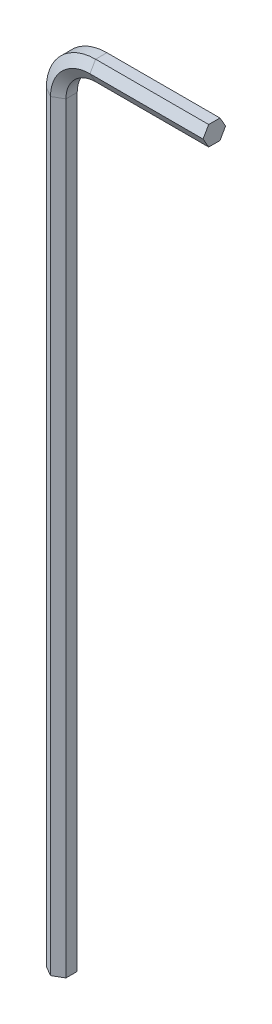
ISO-10303-21;
HEADER;
FILE_DESCRIPTION(('STEP AP214'),'2;1');
FILE_NAME('part.step','',(''),(''),'','','');
FILE_SCHEMA(('AUTOMOTIVE_DESIGN { 1 0 10303 214 1 1 1 1 }'));
ENDSEC;
DATA;
#1=APPLICATION_CONTEXT('core data for automotive mechanical design processes');
#2=APPLICATION_PROTOCOL_DEFINITION('international standard','automotive_design',2000,#1);
#3=PRODUCT_CONTEXT('',#1,'mechanical');
#4=PRODUCT('Part','Part','',(#3));
#5=PRODUCT_RELATED_PRODUCT_CATEGORY('part','',(#4));
#6=PRODUCT_DEFINITION_FORMATION('','',#4);
#7=PRODUCT_DEFINITION_CONTEXT('part definition',#1,'design');
#8=PRODUCT_DEFINITION('design','',#6,#7);
#9=PRODUCT_DEFINITION_SHAPE('','',#8);
#10=(LENGTH_UNIT() NAMED_UNIT(*) SI_UNIT(.MILLI.,.METRE.));
#11=(NAMED_UNIT(*) PLANE_ANGLE_UNIT() SI_UNIT($,.RADIAN.));
#12=(NAMED_UNIT(*) SI_UNIT($,.STERADIAN.) SOLID_ANGLE_UNIT());
#13=UNCERTAINTY_MEASURE_WITH_UNIT(LENGTH_MEASURE(1.E-05),#10,'distance_accuracy_value','');
#14=(GEOMETRIC_REPRESENTATION_CONTEXT(3) GLOBAL_UNCERTAINTY_ASSIGNED_CONTEXT((#13)) GLOBAL_UNIT_ASSIGNED_CONTEXT((#10,
#11,#12)) REPRESENTATION_CONTEXT('',''));
#15=CARTESIAN_POINT('',(0.,0.,0.));
#16=DIRECTION('',(0.,0.,1.));
#17=DIRECTION('',(1.,0.,0.));
#18=AXIS2_PLACEMENT_3D('',#15,#16,#17);
#19=CARTESIAN_POINT('',(4.00000000000005,82.2,-0.571923176659244));
#20=DIRECTION('',(0.,1.,0.));
#21=DIRECTION('',(0.,0.,1.));
#22=AXIS2_PLACEMENT_3D('',#19,#20,#21);
#23=PLANE('',#22);
#24=DIRECTION('',(0.,0.,1.));
#25=VECTOR('',#24,1.);
#26=CARTESIAN_POINT('',(4.00000000000005,82.2,-0.571923176659244));
#27=LINE('',#26,#25);
#28=CARTESIAN_POINT('',(4.00000000000005,82.2,-0.571923176659244));
#29=VERTEX_POINT('',#28);
#30=CARTESIAN_POINT('',(4.00000000000005,82.2,0.571923176659243));
#31=VERTEX_POINT('',#30);
#32=EDGE_CURVE('E143',#29,#31,#27,.T.);
#33=ORIENTED_EDGE('',*,*,#32,.T.);
#34=DIRECTION('',(1.,0.,0.));
#35=VECTOR('',#34,1.);
#36=CARTESIAN_POINT('',(4.00000000000005,82.2,0.571923176659243));
#37=LINE('',#36,#35);
#38=CARTESIAN_POINT('',(15.4694,82.2,0.571923176659243));
#39=VERTEX_POINT('',#38);
#40=EDGE_CURVE('E23',#31,#39,#37,.T.);
#41=ORIENTED_EDGE('',*,*,#40,.T.);
#42=DIRECTION('',(0.,0.,1.));
#43=VECTOR('',#42,1.);
#44=CARTESIAN_POINT('',(15.4694,82.2,-0.571923176659244));
#45=LINE('',#44,#43);
#46=CARTESIAN_POINT('',(15.4694,82.2,-0.571923176659244));
#47=VERTEX_POINT('',#46);
#48=EDGE_CURVE('E35',#47,#39,#45,.T.);
#49=ORIENTED_EDGE('',*,*,#48,.F.);
#50=DIRECTION('',(1.,0.,0.));
#51=VECTOR('',#50,1.);
#52=CARTESIAN_POINT('',(4.00000000000005,82.2,-0.571923176659244));
#53=LINE('',#52,#51);
#54=EDGE_CURVE('E10',#29,#47,#53,.T.);
#55=ORIENTED_EDGE('',*,*,#54,.F.);
#56=EDGE_LOOP('',(#33,#41,#49,#55));
#57=FACE_BOUND('',#56,.T.);
#58=ADVANCED_FACE('F15',(#57),#23,.T.);
#59=CARTESIAN_POINT('',(4.00000000000005,82.2,0.571923176659243));
#60=DIRECTION('',(0.,0.5,0.866025403784439));
#61=DIRECTION('',(0.,-0.866025403784439,0.5));
#62=AXIS2_PLACEMENT_3D('',#59,#60,#61);
#63=PLANE('',#62);
#64=DIRECTION('',(0.,-0.866025403784439,0.5));
#65=VECTOR('',#64,1.);
#66=CARTESIAN_POINT('',(4.00000000000005,82.2,0.571923176659243));
#67=LINE('',#66,#65);
#68=CARTESIAN_POINT('',(4.00000000000003,81.2094,1.14384635331849));
#69=VERTEX_POINT('',#68);
#70=EDGE_CURVE('E201',#31,#69,#67,.T.);
#71=ORIENTED_EDGE('',*,*,#70,.T.);
#72=DIRECTION('',(1.,0.,0.));
#73=VECTOR('',#72,1.);
#74=CARTESIAN_POINT('',(4.00000000000003,81.2094,1.14384635331849));
#75=LINE('',#74,#73);
#76=CARTESIAN_POINT('',(15.4694,81.2094,1.14384635331849));
#77=VERTEX_POINT('',#76);
#78=EDGE_CURVE('E253',#69,#77,#75,.T.);
#79=ORIENTED_EDGE('',*,*,#78,.T.);
#80=DIRECTION('',(0.,-0.866025403784439,0.5));
#81=VECTOR('',#80,1.);
#82=CARTESIAN_POINT('',(15.4694,82.2,0.571923176659243));
#83=LINE('',#82,#81);
#84=EDGE_CURVE('E45',#39,#77,#83,.T.);
#85=ORIENTED_EDGE('',*,*,#84,.F.);
#86=ORIENTED_EDGE('',*,*,#40,.F.);
#87=EDGE_LOOP('',(#71,#79,#85,#86));
#88=FACE_BOUND('',#87,.T.);
#89=ADVANCED_FACE('F258',(#88),#63,.T.);
#90=CARTESIAN_POINT('',(4.00000000000003,81.2094,1.14384635331849));
#91=DIRECTION('',(0.,-0.5,0.866025403784439));
#92=DIRECTION('',(0.,-0.866025403784439,-0.5));
#93=AXIS2_PLACEMENT_3D('',#90,#91,#92);
#94=PLANE('',#93);
#95=DIRECTION('',(0.,-0.866025403784439,-0.5));
#96=VECTOR('',#95,1.);
#97=CARTESIAN_POINT('',(4.00000000000003,81.2094,1.14384635331849));
#98=LINE('',#97,#96);
#99=CARTESIAN_POINT('',(4.00000000000002,80.2188,0.571923176659244));
#100=VERTEX_POINT('',#99);
#101=EDGE_CURVE('E197',#69,#100,#98,.T.);
#102=ORIENTED_EDGE('',*,*,#101,.T.);
#103=DIRECTION('',(1.,0.,0.));
#104=VECTOR('',#103,1.);
#105=CARTESIAN_POINT('',(4.00000000000002,80.2188,0.571923176659244));
#106=LINE('',#105,#104);
#107=CARTESIAN_POINT('',(15.4694,80.2188,0.571923176659244));
#108=VERTEX_POINT('',#107);
#109=EDGE_CURVE('E249',#100,#108,#106,.T.);
#110=ORIENTED_EDGE('',*,*,#109,.T.);
#111=DIRECTION('',(0.,-0.866025403784439,-0.5));
#112=VECTOR('',#111,1.);
#113=CARTESIAN_POINT('',(15.4694,81.2094,1.14384635331849));
#114=LINE('',#113,#112);
#115=EDGE_CURVE('E233',#77,#108,#114,.T.);
#116=ORIENTED_EDGE('',*,*,#115,.F.);
#117=ORIENTED_EDGE('',*,*,#78,.F.);
#118=EDGE_LOOP('',(#102,#110,#116,#117));
#119=FACE_BOUND('',#118,.T.);
#120=ADVANCED_FACE('F339',(#119),#94,.T.);
#121=CARTESIAN_POINT('',(4.00000000000002,80.2188,0.571923176659244));
#122=DIRECTION('',(0.,-1.,0.));
#123=DIRECTION('',(0.,0.,-1.));
#124=AXIS2_PLACEMENT_3D('',#121,#122,#123);
#125=PLANE('',#124);
#126=DIRECTION('',(0.,0.,-1.));
#127=VECTOR('',#126,1.);
#128=CARTESIAN_POINT('',(4.00000000000002,80.2188,0.571923176659244));
#129=LINE('',#128,#127);
#130=CARTESIAN_POINT('',(4.00000000000002,80.2188,-0.571923176659243));
#131=VERTEX_POINT('',#130);
#132=EDGE_CURVE('E193',#100,#131,#129,.T.);
#133=ORIENTED_EDGE('',*,*,#132,.T.);
#134=DIRECTION('',(1.,0.,0.));
#135=VECTOR('',#134,1.);
#136=CARTESIAN_POINT('',(4.00000000000002,80.2188,-0.571923176659243));
#137=LINE('',#136,#135);
#138=CARTESIAN_POINT('',(15.4694,80.2188,-0.571923176659243));
#139=VERTEX_POINT('',#138);
#140=EDGE_CURVE('E245',#131,#139,#137,.T.);
#141=ORIENTED_EDGE('',*,*,#140,.T.);
#142=DIRECTION('',(0.,0.,-1.));
#143=VECTOR('',#142,1.);
#144=CARTESIAN_POINT('',(15.4694,80.2188,0.571923176659244));
#145=LINE('',#144,#143);
#146=EDGE_CURVE('E229',#108,#139,#145,.T.);
#147=ORIENTED_EDGE('',*,*,#146,.F.);
#148=ORIENTED_EDGE('',*,*,#109,.F.);
#149=EDGE_LOOP('',(#133,#141,#147,#148));
#150=FACE_BOUND('',#149,.T.);
#151=ADVANCED_FACE('F338',(#150),#125,.T.);
#152=CARTESIAN_POINT('',(4.00000000000002,80.2188,-0.571923176659243));
#153=DIRECTION('',(0.,-0.5,-0.866025403784438));
#154=DIRECTION('',(0.,0.866025403784439,-0.5));
#155=AXIS2_PLACEMENT_3D('',#152,#153,#154);
#156=PLANE('',#155);
#157=DIRECTION('',(0.,0.866025403784439,-0.5));
#158=VECTOR('',#157,1.);
#159=CARTESIAN_POINT('',(4.00000000000002,80.2188,-0.571923176659243));
#160=LINE('',#159,#158);
#161=CARTESIAN_POINT('',(4.00000000000003,81.2094,-1.14384635331849));
#162=VERTEX_POINT('',#161);
#163=EDGE_CURVE('E184',#131,#162,#160,.T.);
#164=ORIENTED_EDGE('',*,*,#163,.T.);
#165=DIRECTION('',(1.,0.,0.));
#166=VECTOR('',#165,1.);
#167=CARTESIAN_POINT('',(4.00000000000003,81.2094,-1.14384635331849));
#168=LINE('',#167,#166);
#169=CARTESIAN_POINT('',(15.4694,81.2094,-1.14384635331849));
#170=VERTEX_POINT('',#169);
#171=EDGE_CURVE('E241',#162,#170,#168,.T.);
#172=ORIENTED_EDGE('',*,*,#171,.T.);
#173=DIRECTION('',(0.,0.866025403784439,-0.5));
#174=VECTOR('',#173,1.);
#175=CARTESIAN_POINT('',(15.4694,80.2188,-0.571923176659243));
#176=LINE('',#175,#174);
#177=EDGE_CURVE('E225',#139,#170,#176,.T.);
#178=ORIENTED_EDGE('',*,*,#177,.F.);
#179=ORIENTED_EDGE('',*,*,#140,.F.);
#180=EDGE_LOOP('',(#164,#172,#178,#179));
#181=FACE_BOUND('',#180,.T.);
#182=ADVANCED_FACE('F345',(#181),#156,.T.);
#183=CARTESIAN_POINT('',(4.00000000000003,81.2094,-1.14384635331849));
#184=DIRECTION('',(0.,0.5,-0.866025403784439));
#185=DIRECTION('',(0.,0.866025403784439,0.5));
#186=AXIS2_PLACEMENT_3D('',#183,#184,#185);
#187=PLANE('',#186);
#188=DIRECTION('',(0.,0.866025403784439,0.5));
#189=VECTOR('',#188,1.);
#190=CARTESIAN_POINT('',(4.00000000000003,81.2094,-1.14384635331849));
#191=LINE('',#190,#189);
#192=EDGE_CURVE('E177',#162,#29,#191,.T.);
#193=ORIENTED_EDGE('',*,*,#192,.T.);
#194=ORIENTED_EDGE('',*,*,#54,.T.);
#195=DIRECTION('',(0.,0.866025403784439,0.5));
#196=VECTOR('',#195,1.);
#197=CARTESIAN_POINT('',(15.4694,81.2094,-1.14384635331849));
#198=LINE('',#197,#196);
#199=EDGE_CURVE('E147',#170,#47,#198,.T.);
#200=ORIENTED_EDGE('',*,*,#199,.F.);
#201=ORIENTED_EDGE('',*,*,#171,.F.);
#202=EDGE_LOOP('',(#193,#194,#200,#201));
#203=FACE_BOUND('',#202,.T.);
#204=ADVANCED_FACE('F343',(#203),#187,.T.);
#205=CARTESIAN_POINT('',(4.,77.2094,0.));
#206=DIRECTION('',(0.,0.,-1.));
#207=DIRECTION('',(-1.,0.,0.));
#208=AXIS2_PLACEMENT_3D('',#205,#206,#207);
#209=CYLINDRICAL_SURFACE('',#208,4.9906);
#210=DIRECTION('',(0.,0.,1.));
#211=VECTOR('',#210,1.);
#212=CARTESIAN_POINT('',(-0.9906,77.2094,-0.571923176659244));
#213=LINE('',#212,#211);
#214=CARTESIAN_POINT('',(-0.9906,77.2094,-0.571923176659244));
#215=VERTEX_POINT('',#214);
#216=CARTESIAN_POINT('',(-0.9906,77.2094,0.571923176659243));
#217=VERTEX_POINT('',#216);
#218=EDGE_CURVE('E140',#215,#217,#213,.T.);
#219=ORIENTED_EDGE('',*,*,#218,.T.);
#220=CARTESIAN_POINT('',(4.,77.2094,0.571923176659243));
#221=DIRECTION('',(0.,0.,-1.));
#222=DIRECTION('',(-1.,0.,0.));
#223=AXIS2_PLACEMENT_3D('',#220,#221,#222);
#224=CIRCLE('',#223,4.9906);
#225=EDGE_CURVE('E148',#217,#31,#224,.T.);
#226=ORIENTED_EDGE('',*,*,#225,.T.);
#227=ORIENTED_EDGE('',*,*,#32,.F.);
#228=CARTESIAN_POINT('',(4.,77.2094,-0.571923176659244));
#229=DIRECTION('',(0.,0.,-1.));
#230=DIRECTION('',(-1.,0.,0.));
#231=AXIS2_PLACEMENT_3D('',#228,#229,#230);
#232=CIRCLE('',#231,4.9906);
#233=EDGE_CURVE('E135',#215,#29,#232,.T.);
#234=ORIENTED_EDGE('',*,*,#233,.F.);
#235=EDGE_LOOP('',(#219,#226,#227,#234));
#236=FACE_BOUND('',#235,.T.);
#237=ADVANCED_FACE('F137',(#236),#209,.T.);
#238=CARTESIAN_POINT('',(4.,77.2094,0.571923176659243));
#239=DIRECTION('',(0.,0.,-1.));
#240=DIRECTION('',(-1.,0.,0.));
#241=AXIS2_PLACEMENT_3D('',#238,#239,#240);
#242=CONICAL_SURFACE('',#241,4.9906,1.0471975511966);
#243=DIRECTION('',(0.866025403784439,0.,0.5));
#244=VECTOR('',#243,1.);
#245=CARTESIAN_POINT('',(-0.9906,77.2094,0.571923176659243));
#246=LINE('',#245,#244);
#247=CARTESIAN_POINT('',(0.,77.2094,1.14384635331849));
#248=VERTEX_POINT('',#247);
#249=EDGE_CURVE('E171',#217,#248,#246,.T.);
#250=ORIENTED_EDGE('',*,*,#249,.T.);
#251=CARTESIAN_POINT('',(4.,77.2094,1.14384635331849));
#252=DIRECTION('',(0.,0.,-1.));
#253=DIRECTION('',(-1.,0.,0.));
#254=AXIS2_PLACEMENT_3D('',#251,#252,#253);
#255=CIRCLE('',#254,4.);
#256=EDGE_CURVE('E217',#248,#69,#255,.T.);
#257=ORIENTED_EDGE('',*,*,#256,.T.);
#258=ORIENTED_EDGE('',*,*,#70,.F.);
#259=ORIENTED_EDGE('',*,*,#225,.F.);
#260=EDGE_LOOP('',(#250,#257,#258,#259));
#261=FACE_BOUND('',#260,.T.);
#262=ADVANCED_FACE('F267',(#261),#242,.T.);
#263=CARTESIAN_POINT('',(4.,77.2094,1.14384635331849));
#264=DIRECTION('',(0.,0.,1.));
#265=DIRECTION('',(1.,0.,0.));
#266=AXIS2_PLACEMENT_3D('',#263,#264,#265);
#267=CONICAL_SURFACE('',#266,4.,1.0471975511966);
#268=DIRECTION('',(0.866025403784439,0.,-0.5));
#269=VECTOR('',#268,1.);
#270=CARTESIAN_POINT('',(0.,77.2094,1.14384635331849));
#271=LINE('',#270,#269);
#272=CARTESIAN_POINT('',(0.990600000000001,77.2094,0.571923176659244));
#273=VERTEX_POINT('',#272);
#274=EDGE_CURVE('E271',#248,#273,#271,.T.);
#275=ORIENTED_EDGE('',*,*,#274,.T.);
#276=CARTESIAN_POINT('',(4.,77.2094,0.571923176659244));
#277=DIRECTION('',(0.,0.,-1.));
#278=DIRECTION('',(-1.,0.,0.));
#279=AXIS2_PLACEMENT_3D('',#276,#277,#278);
#280=CIRCLE('',#279,3.0094);
#281=EDGE_CURVE('E213',#273,#100,#280,.T.);
#282=ORIENTED_EDGE('',*,*,#281,.T.);
#283=ORIENTED_EDGE('',*,*,#101,.F.);
#284=ORIENTED_EDGE('',*,*,#256,.F.);
#285=EDGE_LOOP('',(#275,#282,#283,#284));
#286=FACE_BOUND('',#285,.T.);
#287=ADVANCED_FACE('F263',(#286),#267,.F.);
#288=CARTESIAN_POINT('',(4.,77.2094,0.));
#289=DIRECTION('',(0.,0.,-1.));
#290=DIRECTION('',(-1.,0.,0.));
#291=AXIS2_PLACEMENT_3D('',#288,#289,#290);
#292=CYLINDRICAL_SURFACE('',#291,3.0094);
#293=DIRECTION('',(0.,0.,-1.));
#294=VECTOR('',#293,1.);
#295=CARTESIAN_POINT('',(0.990600000000001,77.2094,0.571923176659244));
#296=LINE('',#295,#294);
#297=CARTESIAN_POINT('',(0.990600000000001,77.2094,-0.571923176659243));
#298=VERTEX_POINT('',#297);
#299=EDGE_CURVE('E287',#273,#298,#296,.T.);
#300=ORIENTED_EDGE('',*,*,#299,.T.);
#301=CARTESIAN_POINT('',(4.,77.2094,-0.571923176659243));
#302=DIRECTION('',(0.,0.,-1.));
#303=DIRECTION('',(-1.,0.,0.));
#304=AXIS2_PLACEMENT_3D('',#301,#302,#303);
#305=CIRCLE('',#304,3.0094);
#306=EDGE_CURVE('E209',#298,#131,#305,.T.);
#307=ORIENTED_EDGE('',*,*,#306,.T.);
#308=ORIENTED_EDGE('',*,*,#132,.F.);
#309=ORIENTED_EDGE('',*,*,#281,.F.);
#310=EDGE_LOOP('',(#300,#307,#308,#309));
#311=FACE_BOUND('',#310,.T.);
#312=ADVANCED_FACE('F336',(#311),#292,.F.);
#313=CARTESIAN_POINT('',(4.,77.2094,-0.571923176659243));
#314=DIRECTION('',(0.,0.,-1.));
#315=DIRECTION('',(-1.,0.,0.));
#316=AXIS2_PLACEMENT_3D('',#313,#314,#315);
#317=CONICAL_SURFACE('',#316,3.0094,1.0471975511966);
#318=DIRECTION('',(-0.866025403784439,0.,-0.5));
#319=VECTOR('',#318,1.);
#320=CARTESIAN_POINT('',(0.990600000000001,77.2094,-0.571923176659243));
#321=LINE('',#320,#319);
#322=CARTESIAN_POINT('',(0.,77.2094,-1.14384635331849));
#323=VERTEX_POINT('',#322);
#324=EDGE_CURVE('E292',#298,#323,#321,.T.);
#325=ORIENTED_EDGE('',*,*,#324,.T.);
#326=CARTESIAN_POINT('',(4.,77.2094,-1.14384635331849));
#327=DIRECTION('',(0.,0.,-1.));
#328=DIRECTION('',(-1.,0.,0.));
#329=AXIS2_PLACEMENT_3D('',#326,#327,#328);
#330=CIRCLE('',#329,4.);
#331=EDGE_CURVE('E154',#323,#162,#330,.T.);
#332=ORIENTED_EDGE('',*,*,#331,.T.);
#333=ORIENTED_EDGE('',*,*,#163,.F.);
#334=ORIENTED_EDGE('',*,*,#306,.F.);
#335=EDGE_LOOP('',(#325,#332,#333,#334));
#336=FACE_BOUND('',#335,.T.);
#337=ADVANCED_FACE('F333',(#336),#317,.F.);
#338=CARTESIAN_POINT('',(4.,77.2094,-1.14384635331849));
#339=DIRECTION('',(0.,0.,1.));
#340=DIRECTION('',(1.,0.,0.));
#341=AXIS2_PLACEMENT_3D('',#338,#339,#340);
#342=CONICAL_SURFACE('',#341,4.,1.0471975511966);
#343=DIRECTION('',(-0.866025403784439,0.,0.5));
#344=VECTOR('',#343,1.);
#345=CARTESIAN_POINT('',(0.,77.2094,-1.14384635331849));
#346=LINE('',#345,#344);
#347=EDGE_CURVE('E151',#323,#215,#346,.T.);
#348=ORIENTED_EDGE('',*,*,#347,.T.);
#349=ORIENTED_EDGE('',*,*,#233,.T.);
#350=ORIENTED_EDGE('',*,*,#192,.F.);
#351=ORIENTED_EDGE('',*,*,#331,.F.);
#352=EDGE_LOOP('',(#348,#349,#350,#351));
#353=FACE_BOUND('',#352,.T.);
#354=ADVANCED_FACE('F152',(#353),#342,.T.);
#355=CARTESIAN_POINT('',(0.,77.2094,-1.14384635331849));
#356=DIRECTION('',(0.5,0.,0.866025403784439));
#357=DIRECTION('',(0.866025403784439,0.,-0.5));
#358=AXIS2_PLACEMENT_3D('',#355,#356,#357);
#359=PLANE('',#358);
#360=DIRECTION('',(-0.866025403784439,0.,0.5));
#361=VECTOR('',#360,1.);
#362=CARTESIAN_POINT('',(0.,0.,-1.14384635331849));
#363=LINE('',#362,#361);
#364=CARTESIAN_POINT('',(0.,0.,-1.14384635331849));
#365=VERTEX_POINT('',#364);
#366=CARTESIAN_POINT('',(-0.9906,0.,-0.571923176659244));
#367=VERTEX_POINT('',#366);
#368=EDGE_CURVE('E175',#365,#367,#363,.T.);
#369=ORIENTED_EDGE('',*,*,#368,.T.);
#370=DIRECTION('',(0.,-1.,0.));
#371=VECTOR('',#370,1.);
#372=CARTESIAN_POINT('',(-0.9906,77.2094,-0.571923176659244));
#373=LINE('',#372,#371);
#374=EDGE_CURVE('E165',#215,#367,#373,.T.);
#375=ORIENTED_EDGE('',*,*,#374,.F.);
#376=ORIENTED_EDGE('',*,*,#347,.F.);
#377=DIRECTION('',(0.,-1.,0.));
#378=VECTOR('',#377,1.);
#379=CARTESIAN_POINT('',(0.,77.2094,-1.14384635331849));
#380=LINE('',#379,#378);
#381=EDGE_CURVE('E297',#323,#365,#380,.T.);
#382=ORIENTED_EDGE('',*,*,#381,.T.);
#383=EDGE_LOOP('',(#369,#375,#376,#382));
#384=FACE_BOUND('',#383,.T.);
#385=ADVANCED_FACE('F173',(#384),#359,.F.);
#386=CARTESIAN_POINT('',(-0.9906,77.2094,-0.571923176659244));
#387=DIRECTION('',(1.,0.,0.));
#388=DIRECTION('',(0.,0.,-1.));
#389=AXIS2_PLACEMENT_3D('',#386,#387,#388);
#390=PLANE('',#389);
#391=DIRECTION('',(0.,0.,1.));
#392=VECTOR('',#391,1.);
#393=CARTESIAN_POINT('',(-0.9906,0.,-0.571923176659244));
#394=LINE('',#393,#392);
#395=CARTESIAN_POINT('',(-0.9906,0.,0.571923176659243));
#396=VERTEX_POINT('',#395);
#397=EDGE_CURVE('E300',#367,#396,#394,.T.);
#398=ORIENTED_EDGE('',*,*,#397,.T.);
#399=DIRECTION('',(0.,-1.,0.));
#400=VECTOR('',#399,1.);
#401=CARTESIAN_POINT('',(-0.9906,77.2094,0.571923176659243));
#402=LINE('',#401,#400);
#403=EDGE_CURVE('E168',#217,#396,#402,.T.);
#404=ORIENTED_EDGE('',*,*,#403,.F.);
#405=ORIENTED_EDGE('',*,*,#218,.F.);
#406=ORIENTED_EDGE('',*,*,#374,.T.);
#407=EDGE_LOOP('',(#398,#404,#405,#406));
#408=FACE_BOUND('',#407,.T.);
#409=ADVANCED_FACE('F164',(#408),#390,.F.);
#410=CARTESIAN_POINT('',(-0.9906,77.2094,0.571923176659243));
#411=DIRECTION('',(0.5,0.,-0.866025403784439));
#412=DIRECTION('',(-0.866025403784439,0.,-0.5));
#413=AXIS2_PLACEMENT_3D('',#410,#411,#412);
#414=PLANE('',#413);
#415=DIRECTION('',(0.866025403784439,0.,0.5));
#416=VECTOR('',#415,1.);
#417=CARTESIAN_POINT('',(-0.9906,0.,0.571923176659243));
#418=LINE('',#417,#416);
#419=CARTESIAN_POINT('',(0.,0.,1.14384635331849));
#420=VERTEX_POINT('',#419);
#421=EDGE_CURVE('E277',#396,#420,#418,.T.);
#422=ORIENTED_EDGE('',*,*,#421,.T.);
#423=DIRECTION('',(0.,-1.,0.));
#424=VECTOR('',#423,1.);
#425=CARTESIAN_POINT('',(0.,77.2094,1.14384635331849));
#426=LINE('',#425,#424);
#427=EDGE_CURVE('E186',#248,#420,#426,.T.);
#428=ORIENTED_EDGE('',*,*,#427,.F.);
#429=ORIENTED_EDGE('',*,*,#249,.F.);
#430=ORIENTED_EDGE('',*,*,#403,.T.);
#431=EDGE_LOOP('',(#422,#428,#429,#430));
#432=FACE_BOUND('',#431,.T.);
#433=ADVANCED_FACE('F275',(#432),#414,.F.);
#434=CARTESIAN_POINT('',(0.,77.2094,1.14384635331849));
#435=DIRECTION('',(-0.5,0.,-0.866025403784439));
#436=DIRECTION('',(-0.866025403784439,0.,0.5));
#437=AXIS2_PLACEMENT_3D('',#434,#435,#436);
#438=PLANE('',#437);
#439=DIRECTION('',(0.866025403784439,0.,-0.5));
#440=VECTOR('',#439,1.);
#441=CARTESIAN_POINT('',(0.,0.,1.14384635331849));
#442=LINE('',#441,#440);
#443=CARTESIAN_POINT('',(0.990600000000001,0.,0.571923176659244));
#444=VERTEX_POINT('',#443);
#445=EDGE_CURVE('E305',#420,#444,#442,.T.);
#446=ORIENTED_EDGE('',*,*,#445,.T.);
#447=DIRECTION('',(0.,-1.,0.));
#448=VECTOR('',#447,1.);
#449=CARTESIAN_POINT('',(0.990600000000001,77.2094,0.571923176659244));
#450=LINE('',#449,#448);
#451=EDGE_CURVE('E281',#273,#444,#450,.T.);
#452=ORIENTED_EDGE('',*,*,#451,.F.);
#453=ORIENTED_EDGE('',*,*,#274,.F.);
#454=ORIENTED_EDGE('',*,*,#427,.T.);
#455=EDGE_LOOP('',(#446,#452,#453,#454));
#456=FACE_BOUND('',#455,.T.);
#457=ADVANCED_FACE('F283',(#456),#438,.F.);
#458=CARTESIAN_POINT('',(0.990600000000001,77.2094,0.571923176659244));
#459=DIRECTION('',(-1.,0.,0.));
#460=DIRECTION('',(0.,0.,1.));
#461=AXIS2_PLACEMENT_3D('',#458,#459,#460);
#462=PLANE('',#461);
#463=DIRECTION('',(0.,0.,-1.));
#464=VECTOR('',#463,1.);
#465=CARTESIAN_POINT('',(0.990600000000001,0.,0.571923176659244));
#466=LINE('',#465,#464);
#467=CARTESIAN_POINT('',(0.990600000000001,0.,-0.571923176659243));
#468=VERTEX_POINT('',#467);
#469=EDGE_CURVE('E308',#444,#468,#466,.T.);
#470=ORIENTED_EDGE('',*,*,#469,.T.);
#471=DIRECTION('',(0.,-1.,0.));
#472=VECTOR('',#471,1.);
#473=CARTESIAN_POINT('',(0.990600000000001,77.2094,-0.571923176659243));
#474=LINE('',#473,#472);
#475=EDGE_CURVE('E315',#298,#468,#474,.T.);
#476=ORIENTED_EDGE('',*,*,#475,.F.);
#477=ORIENTED_EDGE('',*,*,#299,.F.);
#478=ORIENTED_EDGE('',*,*,#451,.T.);
#479=EDGE_LOOP('',(#470,#476,#477,#478));
#480=FACE_BOUND('',#479,.T.);
#481=ADVANCED_FACE('F323',(#480),#462,.F.);
#482=CARTESIAN_POINT('',(0.990600000000001,77.2094,-0.571923176659243));
#483=DIRECTION('',(-0.5,0.,0.866025403784439));
#484=DIRECTION('',(0.866025403784439,0.,0.5));
#485=AXIS2_PLACEMENT_3D('',#482,#483,#484);
#486=PLANE('',#485);
#487=DIRECTION('',(-0.866025403784439,0.,-0.5));
#488=VECTOR('',#487,1.);
#489=CARTESIAN_POINT('',(0.990600000000001,0.,-0.571923176659243));
#490=LINE('',#489,#488);
#491=EDGE_CURVE('E160',#468,#365,#490,.T.);
#492=ORIENTED_EDGE('',*,*,#491,.T.);
#493=ORIENTED_EDGE('',*,*,#381,.F.);
#494=ORIENTED_EDGE('',*,*,#324,.F.);
#495=ORIENTED_EDGE('',*,*,#475,.T.);
#496=EDGE_LOOP('',(#492,#493,#494,#495));
#497=FACE_BOUND('',#496,.T.);
#498=ADVANCED_FACE('F330',(#497),#486,.F.);
#499=CARTESIAN_POINT('',(15.4694,81.2094,0.));
#500=DIRECTION('',(1.,0.,0.));
#501=DIRECTION('',(0.,0.,1.));
#502=AXIS2_PLACEMENT_3D('',#499,#500,#501);
#503=PLANE('',#502);
#504=ORIENTED_EDGE('',*,*,#199,.T.);
#505=ORIENTED_EDGE('',*,*,#48,.T.);
#506=ORIENTED_EDGE('',*,*,#84,.T.);
#507=ORIENTED_EDGE('',*,*,#115,.T.);
#508=ORIENTED_EDGE('',*,*,#146,.T.);
#509=ORIENTED_EDGE('',*,*,#177,.T.);
#510=EDGE_LOOP('',(#504,#505,#506,#507,#508,#509));
#511=FACE_BOUND('',#510,.T.);
#512=ADVANCED_FACE('F341',(#511),#503,.T.);
#513=CARTESIAN_POINT('',(0.,0.,0.));
#514=DIRECTION('',(0.,1.,0.));
#515=DIRECTION('',(0.,0.,1.));
#516=AXIS2_PLACEMENT_3D('',#513,#514,#515);
#517=PLANE('',#516);
#518=ORIENTED_EDGE('',*,*,#368,.F.);
#519=ORIENTED_EDGE('',*,*,#491,.F.);
#520=ORIENTED_EDGE('',*,*,#469,.F.);
#521=ORIENTED_EDGE('',*,*,#445,.F.);
#522=ORIENTED_EDGE('',*,*,#421,.F.);
#523=ORIENTED_EDGE('',*,*,#397,.F.);
#524=EDGE_LOOP('',(#518,#519,#520,#521,#522,#523));
#525=FACE_BOUND('',#524,.T.);
#526=ADVANCED_FACE('F327',(#525),#517,.F.);
#527=CLOSED_SHELL('',(#58,#89,#120,#151,#182,#204,#237,#262,#287,#312,#337,#354,#385,#409,#433,
#457,#481,#498,#512,#526));
#528=MANIFOLD_SOLID_BREP('B1',#527);
#529=ADVANCED_BREP_SHAPE_REPRESENTATION('',(#18,#528),#14);
#530=SHAPE_DEFINITION_REPRESENTATION(#9,#529);
ENDSEC;
END-ISO-10303-21;
